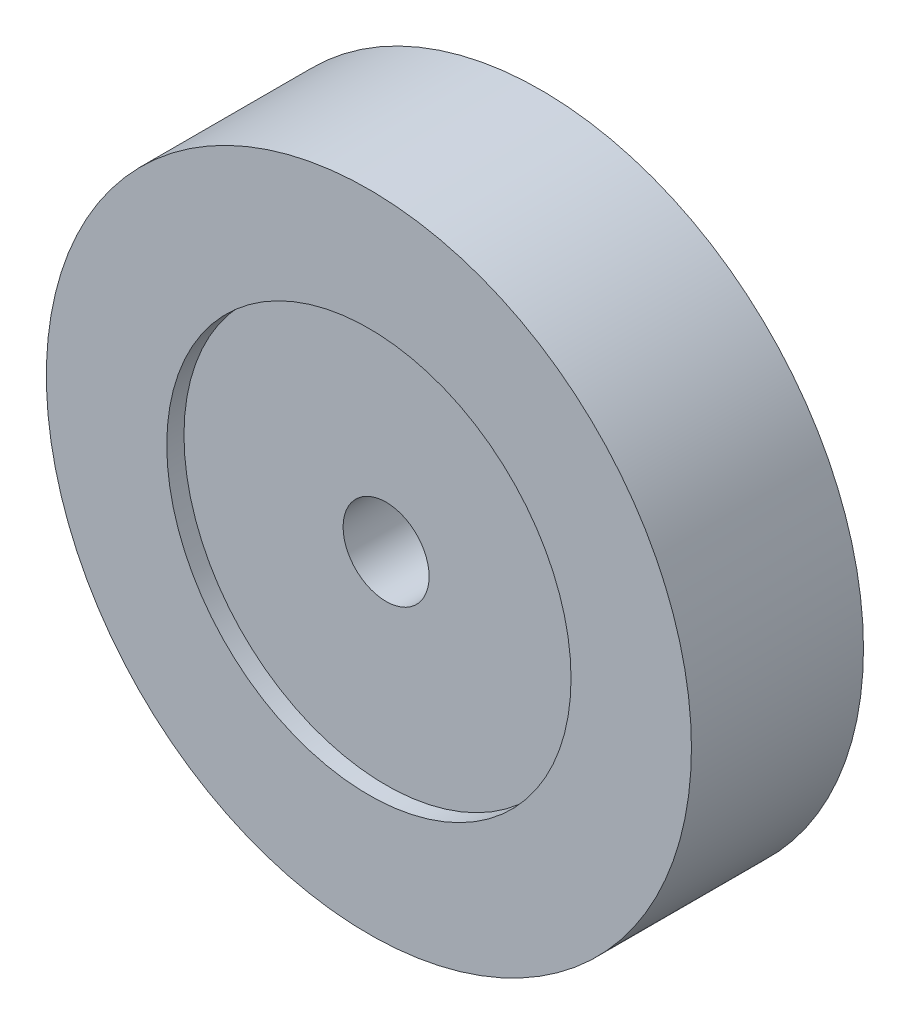
ISO-10303-21;
HEADER;
FILE_DESCRIPTION(('STEP AP214'),'2;1');
FILE_NAME('part.step','',(''),(''),'','','');
FILE_SCHEMA(('AUTOMOTIVE_DESIGN { 1 0 10303 214 1 1 1 1 }'));
ENDSEC;
DATA;
#1=APPLICATION_CONTEXT('core data for automotive mechanical design processes');
#2=APPLICATION_PROTOCOL_DEFINITION('international standard','automotive_design',2000,#1);
#3=PRODUCT_CONTEXT('',#1,'mechanical');
#4=PRODUCT('Part','Part','',(#3));
#5=PRODUCT_RELATED_PRODUCT_CATEGORY('part','',(#4));
#6=PRODUCT_DEFINITION_FORMATION('','',#4);
#7=PRODUCT_DEFINITION_CONTEXT('part definition',#1,'design');
#8=PRODUCT_DEFINITION('design','',#6,#7);
#9=PRODUCT_DEFINITION_SHAPE('','',#8);
#10=(LENGTH_UNIT() NAMED_UNIT(*) SI_UNIT(.MILLI.,.METRE.));
#11=(NAMED_UNIT(*) PLANE_ANGLE_UNIT() SI_UNIT($,.RADIAN.));
#12=(NAMED_UNIT(*) SI_UNIT($,.STERADIAN.) SOLID_ANGLE_UNIT());
#13=UNCERTAINTY_MEASURE_WITH_UNIT(LENGTH_MEASURE(1.E-05),#10,'distance_accuracy_value','');
#14=(GEOMETRIC_REPRESENTATION_CONTEXT(3) GLOBAL_UNCERTAINTY_ASSIGNED_CONTEXT((#13)) GLOBAL_UNIT_ASSIGNED_CONTEXT((#10,
#11,#12)) REPRESENTATION_CONTEXT('',''));
#15=CARTESIAN_POINT('',(0.,0.,0.));
#16=DIRECTION('',(0.,0.,1.));
#17=DIRECTION('',(1.,0.,0.));
#18=AXIS2_PLACEMENT_3D('',#15,#16,#17);
#19=CARTESIAN_POINT('',(0.,0.,2.54));
#20=DIRECTION('',(0.,0.,-1.));
#21=DIRECTION('',(-1.,0.,0.));
#22=AXIS2_PLACEMENT_3D('',#19,#20,#21);
#23=CYLINDRICAL_SURFACE('',#22,0.635);
#24=CARTESIAN_POINT('',(0.,0.,2.286));
#25=DIRECTION('',(0.,0.,1.));
#26=DIRECTION('',(1.,0.,0.));
#27=AXIS2_PLACEMENT_3D('',#24,#25,#26);
#28=CIRCLE('',#27,0.635);
#29=CARTESIAN_POINT('',(0.635,0.,2.286));
#30=VERTEX_POINT('',#29);
#31=EDGE_CURVE('E54',#30,#30,#28,.T.);
#32=ORIENTED_EDGE('',*,*,#31,.T.);
#33=EDGE_LOOP('',(#32));
#34=FACE_BOUND('',#33,.T.);
#35=CARTESIAN_POINT('',(0.,0.,0.254));
#36=DIRECTION('',(0.,0.,-1.));
#37=DIRECTION('',(-1.,0.,0.));
#38=AXIS2_PLACEMENT_3D('',#35,#36,#37);
#39=CIRCLE('',#38,0.635);
#40=CARTESIAN_POINT('',(-0.635,0.,0.254));
#41=VERTEX_POINT('',#40);
#42=EDGE_CURVE('E43',#41,#41,#39,.T.);
#43=ORIENTED_EDGE('',*,*,#42,.T.);
#44=EDGE_LOOP('',(#43));
#45=FACE_BOUND('',#44,.T.);
#46=ADVANCED_FACE('F39',(#34,#45),#23,.F.);
#47=CARTESIAN_POINT('',(0.,0.,2.54));
#48=DIRECTION('',(0.,0.,1.));
#49=DIRECTION('',(1.,0.,0.));
#50=AXIS2_PLACEMENT_3D('',#47,#48,#49);
#51=PLANE('',#50);
#52=CARTESIAN_POINT('',(0.,0.,2.54));
#53=DIRECTION('',(0.,0.,1.));
#54=DIRECTION('',(1.,0.,0.));
#55=AXIS2_PLACEMENT_3D('',#52,#53,#54);
#56=CIRCLE('',#55,2.9845);
#57=CARTESIAN_POINT('',(2.9845,0.,2.54));
#58=VERTEX_POINT('',#57);
#59=EDGE_CURVE('E57',#58,#58,#56,.T.);
#60=ORIENTED_EDGE('',*,*,#59,.F.);
#61=EDGE_LOOP('',(#60));
#62=FACE_BOUND('',#61,.T.);
#63=CARTESIAN_POINT('',(0.,0.,2.54));
#64=DIRECTION('',(0.,0.,1.));
#65=DIRECTION('',(1.,0.,0.));
#66=AXIS2_PLACEMENT_3D('',#63,#64,#65);
#67=CIRCLE('',#66,4.7625);
#68=CARTESIAN_POINT('',(4.7625,0.,2.54));
#69=VERTEX_POINT('',#68);
#70=EDGE_CURVE('E10',#69,#69,#67,.T.);
#71=ORIENTED_EDGE('',*,*,#70,.T.);
#72=EDGE_LOOP('',(#71));
#73=FACE_BOUND('',#72,.T.);
#74=ADVANCED_FACE('F96',(#62,#73),#51,.T.);
#75=CARTESIAN_POINT('',(0.,0.,0.));
#76=DIRECTION('',(0.,0.,1.));
#77=DIRECTION('',(1.,0.,0.));
#78=AXIS2_PLACEMENT_3D('',#75,#76,#77);
#79=PLANE('',#78);
#80=CARTESIAN_POINT('',(0.,0.,0.));
#81=DIRECTION('',(0.,0.,-1.));
#82=DIRECTION('',(-1.,0.,0.));
#83=AXIS2_PLACEMENT_3D('',#80,#81,#82);
#84=CIRCLE('',#83,2.9845);
#85=CARTESIAN_POINT('',(-2.9845,0.,0.));
#86=VERTEX_POINT('',#85);
#87=EDGE_CURVE('E71',#86,#86,#84,.T.);
#88=ORIENTED_EDGE('',*,*,#87,.F.);
#89=EDGE_LOOP('',(#88));
#90=FACE_BOUND('',#89,.T.);
#91=CARTESIAN_POINT('',(0.,0.,0.));
#92=DIRECTION('',(0.,0.,1.));
#93=DIRECTION('',(1.,0.,0.));
#94=AXIS2_PLACEMENT_3D('',#91,#92,#93);
#95=CIRCLE('',#94,4.7625);
#96=CARTESIAN_POINT('',(4.7625,0.,0.));
#97=VERTEX_POINT('',#96);
#98=EDGE_CURVE('E48',#97,#97,#95,.T.);
#99=ORIENTED_EDGE('',*,*,#98,.F.);
#100=EDGE_LOOP('',(#99));
#101=FACE_BOUND('',#100,.T.);
#102=ADVANCED_FACE('F101',(#90,#101),#79,.F.);
#103=CARTESIAN_POINT('',(0.,0.,2.54));
#104=DIRECTION('',(0.,0.,-1.));
#105=DIRECTION('',(-1.,0.,0.));
#106=AXIS2_PLACEMENT_3D('',#103,#104,#105);
#107=CYLINDRICAL_SURFACE('',#106,4.7625);
#108=ORIENTED_EDGE('',*,*,#70,.F.);
#109=EDGE_LOOP('',(#108));
#110=FACE_BOUND('',#109,.T.);
#111=ORIENTED_EDGE('',*,*,#98,.T.);
#112=EDGE_LOOP('',(#111));
#113=FACE_BOUND('',#112,.T.);
#114=ADVANCED_FACE('F41',(#110,#113),#107,.T.);
#115=CARTESIAN_POINT('',(0.,0.,2.286));
#116=DIRECTION('',(0.,0.,1.));
#117=DIRECTION('',(1.,0.,0.));
#118=AXIS2_PLACEMENT_3D('',#115,#116,#117);
#119=CYLINDRICAL_SURFACE('',#118,2.9845);
#120=CARTESIAN_POINT('',(0.,0.,2.286));
#121=DIRECTION('',(0.,0.,1.));
#122=DIRECTION('',(1.,0.,0.));
#123=AXIS2_PLACEMENT_3D('',#120,#121,#122);
#124=CIRCLE('',#123,2.9845);
#125=CARTESIAN_POINT('',(2.9845,0.,2.286));
#126=VERTEX_POINT('',#125);
#127=EDGE_CURVE('E61',#126,#126,#124,.T.);
#128=ORIENTED_EDGE('',*,*,#127,.F.);
#129=EDGE_LOOP('',(#128));
#130=FACE_BOUND('',#129,.T.);
#131=ORIENTED_EDGE('',*,*,#59,.T.);
#132=EDGE_LOOP('',(#131));
#133=FACE_BOUND('',#132,.T.);
#134=ADVANCED_FACE('F105',(#130,#133),#119,.F.);
#135=CARTESIAN_POINT('',(0.,0.,2.286));
#136=DIRECTION('',(0.,0.,1.));
#137=DIRECTION('',(1.,0.,0.));
#138=AXIS2_PLACEMENT_3D('',#135,#136,#137);
#139=PLANE('',#138);
#140=ORIENTED_EDGE('',*,*,#31,.F.);
#141=EDGE_LOOP('',(#140));
#142=FACE_BOUND('',#141,.T.);
#143=ORIENTED_EDGE('',*,*,#127,.T.);
#144=EDGE_LOOP('',(#143));
#145=FACE_BOUND('',#144,.T.);
#146=ADVANCED_FACE('F92',(#142,#145),#139,.T.);
#147=CARTESIAN_POINT('',(0.,0.,0.254));
#148=DIRECTION('',(0.,0.,-1.));
#149=DIRECTION('',(-1.,0.,0.));
#150=AXIS2_PLACEMENT_3D('',#147,#148,#149);
#151=CYLINDRICAL_SURFACE('',#150,2.9845);
#152=CARTESIAN_POINT('',(0.,0.,0.254));
#153=DIRECTION('',(0.,0.,-1.));
#154=DIRECTION('',(-1.,0.,0.));
#155=AXIS2_PLACEMENT_3D('',#152,#153,#154);
#156=CIRCLE('',#155,2.9845);
#157=CARTESIAN_POINT('',(-2.9845,0.,0.254));
#158=VERTEX_POINT('',#157);
#159=EDGE_CURVE('E75',#158,#158,#156,.T.);
#160=ORIENTED_EDGE('',*,*,#159,.F.);
#161=EDGE_LOOP('',(#160));
#162=FACE_BOUND('',#161,.T.);
#163=ORIENTED_EDGE('',*,*,#87,.T.);
#164=EDGE_LOOP('',(#163));
#165=FACE_BOUND('',#164,.T.);
#166=ADVANCED_FACE('F87',(#162,#165),#151,.F.);
#167=CARTESIAN_POINT('',(0.,0.,0.254));
#168=DIRECTION('',(0.,0.,-1.));
#169=DIRECTION('',(-1.,0.,0.));
#170=AXIS2_PLACEMENT_3D('',#167,#168,#169);
#171=PLANE('',#170);
#172=ORIENTED_EDGE('',*,*,#42,.F.);
#173=EDGE_LOOP('',(#172));
#174=FACE_BOUND('',#173,.T.);
#175=ORIENTED_EDGE('',*,*,#159,.T.);
#176=EDGE_LOOP('',(#175));
#177=FACE_BOUND('',#176,.T.);
#178=ADVANCED_FACE('F85',(#174,#177),#171,.T.);
#179=CLOSED_SHELL('',(#46,#74,#102,#114,#134,#146,#166,#178));
#180=MANIFOLD_SOLID_BREP('B2',#179);
#181=ADVANCED_BREP_SHAPE_REPRESENTATION('',(#18,#180),#14);
#182=SHAPE_DEFINITION_REPRESENTATION(#9,#181);
ENDSEC;
END-ISO-10303-21;
